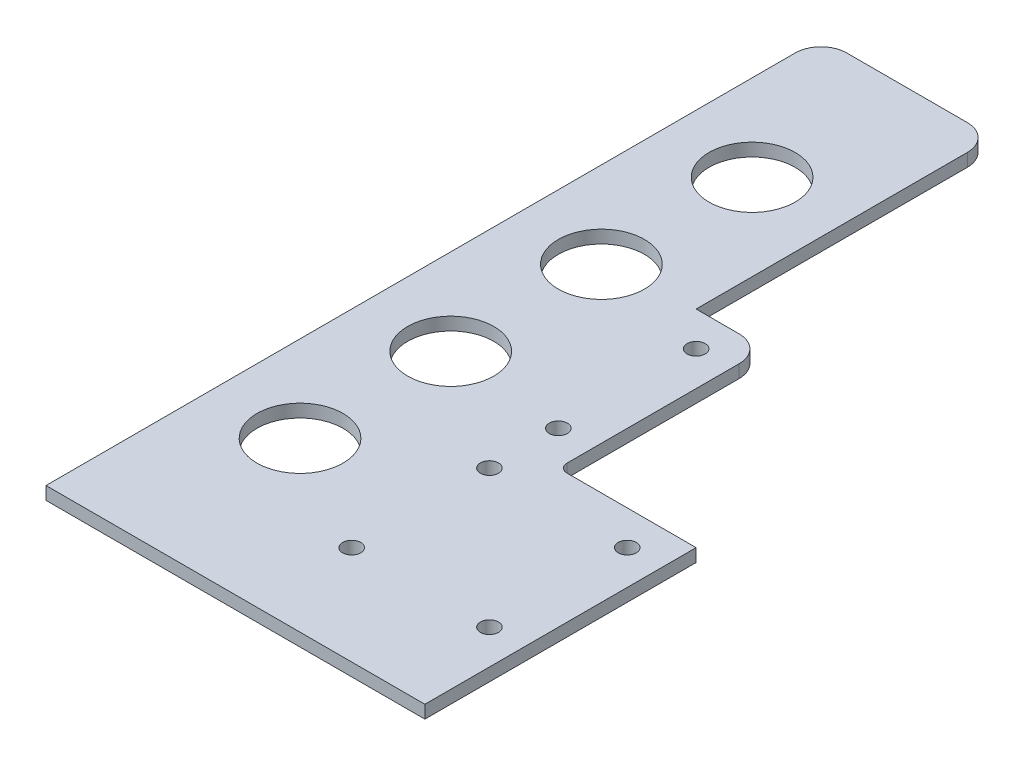
ISO-10303-21;
HEADER;
FILE_DESCRIPTION(('STEP AP214'),'2;1');
FILE_NAME('part.step','',(''),(''),'','','');
FILE_SCHEMA(('AUTOMOTIVE_DESIGN { 1 0 10303 214 1 1 1 1 }'));
ENDSEC;
DATA;
#1=APPLICATION_CONTEXT('core data for automotive mechanical design processes');
#2=APPLICATION_PROTOCOL_DEFINITION('international standard','automotive_design',2000,#1);
#3=PRODUCT_CONTEXT('',#1,'mechanical');
#4=PRODUCT('Part','Part','',(#3));
#5=PRODUCT_RELATED_PRODUCT_CATEGORY('part','',(#4));
#6=PRODUCT_DEFINITION_FORMATION('','',#4);
#7=PRODUCT_DEFINITION_CONTEXT('part definition',#1,'design');
#8=PRODUCT_DEFINITION('design','',#6,#7);
#9=PRODUCT_DEFINITION_SHAPE('','',#8);
#10=(LENGTH_UNIT() NAMED_UNIT(*) SI_UNIT(.MILLI.,.METRE.));
#11=(NAMED_UNIT(*) PLANE_ANGLE_UNIT() SI_UNIT($,.RADIAN.));
#12=(NAMED_UNIT(*) SI_UNIT($,.STERADIAN.) SOLID_ANGLE_UNIT());
#13=UNCERTAINTY_MEASURE_WITH_UNIT(LENGTH_MEASURE(1.E-05),#10,'distance_accuracy_value','');
#14=(GEOMETRIC_REPRESENTATION_CONTEXT(3) GLOBAL_UNCERTAINTY_ASSIGNED_CONTEXT((#13)) GLOBAL_UNIT_ASSIGNED_CONTEXT((#10,
#11,#12)) REPRESENTATION_CONTEXT('',''));
#15=CARTESIAN_POINT('',(0.,0.,0.));
#16=DIRECTION('',(0.,0.,1.));
#17=DIRECTION('',(1.,0.,0.));
#18=AXIS2_PLACEMENT_3D('',#15,#16,#17);
#19=CARTESIAN_POINT('',(-58.,3.,-135.));
#20=DIRECTION('',(0.,-1.,0.));
#21=DIRECTION('',(0.,0.,-1.));
#22=AXIS2_PLACEMENT_3D('',#19,#20,#21);
#23=PLANE('',#22);
#24=DIRECTION('',(0.,0.,1.));
#25=VECTOR('',#24,1.);
#26=CARTESIAN_POINT('',(-64.,3.,43.));
#27=LINE('',#26,#25);
#28=CARTESIAN_POINT('',(-64.,3.,-135.));
#29=VERTEX_POINT('',#28);
#30=CARTESIAN_POINT('',(-64.,3.,39.));
#31=VERTEX_POINT('',#30);
#32=EDGE_CURVE('E165',#29,#31,#27,.T.);
#33=ORIENTED_EDGE('',*,*,#32,.T.);
#34=DIRECTION('',(1.,0.,0.));
#35=VECTOR('',#34,1.);
#36=CARTESIAN_POINT('',(-58.,3.,39.));
#37=LINE('',#36,#35);
#38=CARTESIAN_POINT('',(24.,3.,39.));
#39=VERTEX_POINT('',#38);
#40=EDGE_CURVE('E60',#31,#39,#37,.T.);
#41=ORIENTED_EDGE('',*,*,#40,.T.);
#42=DIRECTION('',(0.,0.,-1.));
#43=VECTOR('',#42,1.);
#44=CARTESIAN_POINT('',(24.,3.,-24.));
#45=LINE('',#44,#43);
#46=CARTESIAN_POINT('',(24.,3.,-24.));
#47=VERTEX_POINT('',#46);
#48=EDGE_CURVE('E115',#39,#47,#45,.T.);
#49=ORIENTED_EDGE('',*,*,#48,.T.);
#50=DIRECTION('',(-1.,0.,0.));
#51=VECTOR('',#50,1.);
#52=CARTESIAN_POINT('',(-5.99999999999999,3.,-24.));
#53=LINE('',#52,#51);
#54=CARTESIAN_POINT('',(-6.,3.,-24.));
#55=VERTEX_POINT('',#54);
#56=EDGE_CURVE('E267',#47,#55,#53,.T.);
#57=ORIENTED_EDGE('',*,*,#56,.T.);
#58=CARTESIAN_POINT('',(-6.,3.,-26.));
#59=DIRECTION('',(0.,-1.,0.));
#60=DIRECTION('',(0.,0.,1.));
#61=AXIS2_PLACEMENT_3D('',#58,#59,#60);
#62=CIRCLE('',#61,2.);
#63=CARTESIAN_POINT('',(-8.,3.,-26.));
#64=VERTEX_POINT('',#63);
#65=EDGE_CURVE('E234',#55,#64,#62,.T.);
#66=ORIENTED_EDGE('',*,*,#65,.T.);
#67=DIRECTION('',(0.,0.,-1.));
#68=VECTOR('',#67,1.);
#69=CARTESIAN_POINT('',(-8.,3.,-26.));
#70=LINE('',#69,#68);
#71=CARTESIAN_POINT('',(-8.,3.,-66.));
#72=VERTEX_POINT('',#71);
#73=EDGE_CURVE('E257',#64,#72,#70,.T.);
#74=ORIENTED_EDGE('',*,*,#73,.T.);
#75=CARTESIAN_POINT('',(-14.,3.,-66.));
#76=DIRECTION('',(0.,1.,0.));
#77=DIRECTION('',(0.,0.,1.));
#78=AXIS2_PLACEMENT_3D('',#75,#76,#77);
#79=CIRCLE('',#78,6.);
#80=CARTESIAN_POINT('',(-14.,3.,-72.));
#81=VERTEX_POINT('',#80);
#82=EDGE_CURVE('E253',#72,#81,#79,.T.);
#83=ORIENTED_EDGE('',*,*,#82,.T.);
#84=DIRECTION('',(-1.,0.,0.));
#85=VECTOR('',#84,1.);
#86=CARTESIAN_POINT('',(-14.,3.,-72.));
#87=LINE('',#86,#85);
#88=CARTESIAN_POINT('',(-24.,3.,-72.));
#89=VERTEX_POINT('',#88);
#90=EDGE_CURVE('E256',#81,#89,#87,.T.);
#91=ORIENTED_EDGE('',*,*,#90,.T.);
#92=DIRECTION('',(0.,0.,-1.));
#93=VECTOR('',#92,1.);
#94=CARTESIAN_POINT('',(-24.,3.,-135.));
#95=LINE('',#94,#93);
#96=CARTESIAN_POINT('',(-24.,3.,-135.));
#97=VERTEX_POINT('',#96);
#98=EDGE_CURVE('E144',#89,#97,#95,.T.);
#99=ORIENTED_EDGE('',*,*,#98,.T.);
#100=CARTESIAN_POINT('',(-30.,3.,-135.));
#101=DIRECTION('',(0.,1.,0.));
#102=DIRECTION('',(0.,0.,1.));
#103=AXIS2_PLACEMENT_3D('',#100,#101,#102);
#104=CIRCLE('',#103,6.);
#105=CARTESIAN_POINT('',(-30.,3.,-141.));
#106=VERTEX_POINT('',#105);
#107=EDGE_CURVE('E137',#97,#106,#104,.T.);
#108=ORIENTED_EDGE('',*,*,#107,.T.);
#109=DIRECTION('',(-1.,0.,0.));
#110=VECTOR('',#109,1.);
#111=CARTESIAN_POINT('',(-58.,3.,-141.));
#112=LINE('',#111,#110);
#113=CARTESIAN_POINT('',(-58.,3.,-141.));
#114=VERTEX_POINT('',#113);
#115=EDGE_CURVE('E141',#106,#114,#112,.T.);
#116=ORIENTED_EDGE('',*,*,#115,.T.);
#117=CARTESIAN_POINT('',(-58.,3.,-135.));
#118=DIRECTION('',(0.,1.,0.));
#119=DIRECTION('',(0.,0.,-1.));
#120=AXIS2_PLACEMENT_3D('',#117,#118,#119);
#121=CIRCLE('',#120,6.);
#122=EDGE_CURVE('E69',#114,#29,#121,.T.);
#123=ORIENTED_EDGE('',*,*,#122,.T.);
#124=EDGE_LOOP('',(#33,#41,#49,#57,#66,#74,#83,#91,#99,#108,#116,#123));
#125=FACE_BOUND('',#124,.T.);
#126=CARTESIAN_POINT('',(16.,3.,-16.));
#127=DIRECTION('',(0.,1.,0.));
#128=DIRECTION('',(0.,0.,1.));
#129=AXIS2_PLACEMENT_3D('',#126,#127,#128);
#130=CIRCLE('',#129,2.1);
#131=CARTESIAN_POINT('',(16.,3.,-13.9));
#132=VERTEX_POINT('',#131);
#133=EDGE_CURVE('E176',#132,#132,#130,.T.);
#134=ORIENTED_EDGE('',*,*,#133,.F.);
#135=EDGE_LOOP('',(#134));
#136=FACE_BOUND('',#135,.T.);
#137=CARTESIAN_POINT('',(16.,3.,16.));
#138=DIRECTION('',(0.,1.,0.));
#139=DIRECTION('',(0.,0.,1.));
#140=AXIS2_PLACEMENT_3D('',#137,#138,#139);
#141=CIRCLE('',#140,2.1);
#142=CARTESIAN_POINT('',(16.,3.,18.1));
#143=VERTEX_POINT('',#142);
#144=EDGE_CURVE('E276',#143,#143,#141,.T.);
#145=ORIENTED_EDGE('',*,*,#144,.F.);
#146=EDGE_LOOP('',(#145));
#147=FACE_BOUND('',#146,.T.);
#148=CARTESIAN_POINT('',(-16.,3.,16.));
#149=DIRECTION('',(0.,1.,0.));
#150=DIRECTION('',(0.,0.,1.));
#151=AXIS2_PLACEMENT_3D('',#148,#149,#150);
#152=CIRCLE('',#151,2.1);
#153=CARTESIAN_POINT('',(-16.,3.,18.1));
#154=VERTEX_POINT('',#153);
#155=EDGE_CURVE('E284',#154,#154,#152,.T.);
#156=ORIENTED_EDGE('',*,*,#155,.F.);
#157=EDGE_LOOP('',(#156));
#158=FACE_BOUND('',#157,.T.);
#159=CARTESIAN_POINT('',(-16.,3.,-16.));
#160=DIRECTION('',(0.,1.,0.));
#161=DIRECTION('',(0.,0.,1.));
#162=AXIS2_PLACEMENT_3D('',#159,#160,#161);
#163=CIRCLE('',#162,2.1);
#164=CARTESIAN_POINT('',(-16.,3.,-13.9));
#165=VERTEX_POINT('',#164);
#166=EDGE_CURVE('E292',#165,#165,#163,.T.);
#167=ORIENTED_EDGE('',*,*,#166,.F.);
#168=EDGE_LOOP('',(#167));
#169=FACE_BOUND('',#168,.T.);
#170=CARTESIAN_POINT('',(-16.0000000000001,3.,-32.));
#171=DIRECTION('',(0.,1.,0.));
#172=DIRECTION('',(0.,0.,1.));
#173=AXIS2_PLACEMENT_3D('',#170,#171,#172);
#174=CIRCLE('',#173,2.1);
#175=CARTESIAN_POINT('',(-16.0000000000001,3.,-29.9));
#176=VERTEX_POINT('',#175);
#177=EDGE_CURVE('E300',#176,#176,#174,.T.);
#178=ORIENTED_EDGE('',*,*,#177,.F.);
#179=EDGE_LOOP('',(#178));
#180=FACE_BOUND('',#179,.T.);
#181=CARTESIAN_POINT('',(-16.0000000000002,3.,-64.));
#182=DIRECTION('',(0.,1.,0.));
#183=DIRECTION('',(0.,0.,1.));
#184=AXIS2_PLACEMENT_3D('',#181,#182,#183);
#185=CIRCLE('',#184,2.1);
#186=CARTESIAN_POINT('',(-16.0000000000002,3.,-61.9));
#187=VERTEX_POINT('',#186);
#188=EDGE_CURVE('E308',#187,#187,#185,.T.);
#189=ORIENTED_EDGE('',*,*,#188,.F.);
#190=EDGE_LOOP('',(#189));
#191=FACE_BOUND('',#190,.T.);
#192=CARTESIAN_POINT('',(-44.,3.,0.));
#193=DIRECTION('',(0.,1.,0.));
#194=DIRECTION('',(0.,0.,1.));
#195=AXIS2_PLACEMENT_3D('',#192,#193,#194);
#196=CIRCLE('',#195,10.);
#197=CARTESIAN_POINT('',(-44.,3.,10.));
#198=VERTEX_POINT('',#197);
#199=EDGE_CURVE('E316',#198,#198,#196,.T.);
#200=ORIENTED_EDGE('',*,*,#199,.F.);
#201=EDGE_LOOP('',(#200));
#202=FACE_BOUND('',#201,.T.);
#203=CARTESIAN_POINT('',(-44.0000000000001,3.,-35.));
#204=DIRECTION('',(0.,1.,0.));
#205=DIRECTION('',(0.,0.,1.));
#206=AXIS2_PLACEMENT_3D('',#203,#204,#205);
#207=CIRCLE('',#206,10.);
#208=CARTESIAN_POINT('',(-44.0000000000001,3.,-25.));
#209=VERTEX_POINT('',#208);
#210=EDGE_CURVE('E324',#209,#209,#207,.T.);
#211=ORIENTED_EDGE('',*,*,#210,.F.);
#212=EDGE_LOOP('',(#211));
#213=FACE_BOUND('',#212,.T.);
#214=CARTESIAN_POINT('',(-44.0000000000002,3.,-70.));
#215=DIRECTION('',(0.,1.,0.));
#216=DIRECTION('',(0.,0.,1.));
#217=AXIS2_PLACEMENT_3D('',#214,#215,#216);
#218=CIRCLE('',#217,10.);
#219=CARTESIAN_POINT('',(-44.0000000000002,3.,-60.));
#220=VERTEX_POINT('',#219);
#221=EDGE_CURVE('E332',#220,#220,#218,.T.);
#222=ORIENTED_EDGE('',*,*,#221,.F.);
#223=EDGE_LOOP('',(#222));
#224=FACE_BOUND('',#223,.T.);
#225=CARTESIAN_POINT('',(-44.0000000000004,3.,-105.));
#226=DIRECTION('',(0.,1.,0.));
#227=DIRECTION('',(0.,0.,1.));
#228=AXIS2_PLACEMENT_3D('',#225,#226,#227);
#229=CIRCLE('',#228,10.);
#230=CARTESIAN_POINT('',(-44.0000000000004,3.,-95.));
#231=VERTEX_POINT('',#230);
#232=EDGE_CURVE('E340',#231,#231,#229,.T.);
#233=ORIENTED_EDGE('',*,*,#232,.F.);
#234=EDGE_LOOP('',(#233));
#235=FACE_BOUND('',#234,.T.);
#236=ADVANCED_FACE('F44',(#125,#136,#147,#158,#169,#180,#191,#202,#213,#224,#235),#23,.F.);
#237=CARTESIAN_POINT('',(-58.,0.,-135.));
#238=DIRECTION('',(0.,-1.,0.));
#239=DIRECTION('',(0.,0.,-1.));
#240=AXIS2_PLACEMENT_3D('',#237,#238,#239);
#241=PLANE('',#240);
#242=DIRECTION('',(-1.,0.,0.));
#243=VECTOR('',#242,1.);
#244=CARTESIAN_POINT('',(-64.,0.,39.));
#245=LINE('',#244,#243);
#246=CARTESIAN_POINT('',(24.,0.,39.));
#247=VERTEX_POINT('',#246);
#248=CARTESIAN_POINT('',(-64.,0.,39.));
#249=VERTEX_POINT('',#248);
#250=EDGE_CURVE('E357',#247,#249,#245,.T.);
#251=ORIENTED_EDGE('',*,*,#250,.T.);
#252=DIRECTION('',(0.,0.,1.));
#253=VECTOR('',#252,1.);
#254=CARTESIAN_POINT('',(-64.,0.,43.));
#255=LINE('',#254,#253);
#256=CARTESIAN_POINT('',(-64.,0.,-135.));
#257=VERTEX_POINT('',#256);
#258=EDGE_CURVE('E201',#257,#249,#255,.T.);
#259=ORIENTED_EDGE('',*,*,#258,.F.);
#260=CARTESIAN_POINT('',(-58.,0.,-135.));
#261=DIRECTION('',(0.,1.,0.));
#262=DIRECTION('',(0.,0.,-1.));
#263=AXIS2_PLACEMENT_3D('',#260,#261,#262);
#264=CIRCLE('',#263,6.);
#265=CARTESIAN_POINT('',(-58.,0.,-141.));
#266=VERTEX_POINT('',#265);
#267=EDGE_CURVE('E108',#266,#257,#264,.T.);
#268=ORIENTED_EDGE('',*,*,#267,.F.);
#269=DIRECTION('',(-1.,0.,0.));
#270=VECTOR('',#269,1.);
#271=CARTESIAN_POINT('',(-58.,0.,-141.));
#272=LINE('',#271,#270);
#273=CARTESIAN_POINT('',(-30.,0.,-141.));
#274=VERTEX_POINT('',#273);
#275=EDGE_CURVE('E196',#274,#266,#272,.T.);
#276=ORIENTED_EDGE('',*,*,#275,.F.);
#277=CARTESIAN_POINT('',(-30.,0.,-135.));
#278=DIRECTION('',(0.,1.,0.));
#279=DIRECTION('',(0.,0.,1.));
#280=AXIS2_PLACEMENT_3D('',#277,#278,#279);
#281=CIRCLE('',#280,6.);
#282=CARTESIAN_POINT('',(-24.,0.,-135.));
#283=VERTEX_POINT('',#282);
#284=EDGE_CURVE('E154',#283,#274,#281,.T.);
#285=ORIENTED_EDGE('',*,*,#284,.F.);
#286=DIRECTION('',(0.,0.,-1.));
#287=VECTOR('',#286,1.);
#288=CARTESIAN_POINT('',(-24.,0.,-135.));
#289=LINE('',#288,#287);
#290=CARTESIAN_POINT('',(-24.,0.,-72.));
#291=VERTEX_POINT('',#290);
#292=EDGE_CURVE('E191',#291,#283,#289,.T.);
#293=ORIENTED_EDGE('',*,*,#292,.F.);
#294=DIRECTION('',(-1.,0.,0.));
#295=VECTOR('',#294,1.);
#296=CARTESIAN_POINT('',(-14.,0.,-72.));
#297=LINE('',#296,#295);
#298=CARTESIAN_POINT('',(-14.,0.,-72.));
#299=VERTEX_POINT('',#298);
#300=EDGE_CURVE('E188',#299,#291,#297,.T.);
#301=ORIENTED_EDGE('',*,*,#300,.F.);
#302=CARTESIAN_POINT('',(-14.,0.,-66.));
#303=DIRECTION('',(0.,1.,0.));
#304=DIRECTION('',(0.,0.,1.));
#305=AXIS2_PLACEMENT_3D('',#302,#303,#304);
#306=CIRCLE('',#305,6.);
#307=CARTESIAN_POINT('',(-8.,0.,-66.));
#308=VERTEX_POINT('',#307);
#309=EDGE_CURVE('E185',#308,#299,#306,.T.);
#310=ORIENTED_EDGE('',*,*,#309,.F.);
#311=DIRECTION('',(0.,0.,-1.));
#312=VECTOR('',#311,1.);
#313=CARTESIAN_POINT('',(-8.,0.,-26.));
#314=LINE('',#313,#312);
#315=CARTESIAN_POINT('',(-8.,0.,-26.));
#316=VERTEX_POINT('',#315);
#317=EDGE_CURVE('E182',#316,#308,#314,.T.);
#318=ORIENTED_EDGE('',*,*,#317,.F.);
#319=CARTESIAN_POINT('',(-6.,0.,-26.));
#320=DIRECTION('',(0.,-1.,0.));
#321=DIRECTION('',(0.,0.,1.));
#322=AXIS2_PLACEMENT_3D('',#319,#320,#321);
#323=CIRCLE('',#322,2.);
#324=CARTESIAN_POINT('',(-6.,0.,-24.));
#325=VERTEX_POINT('',#324);
#326=EDGE_CURVE('E179',#325,#316,#323,.T.);
#327=ORIENTED_EDGE('',*,*,#326,.F.);
#328=DIRECTION('',(-1.,0.,0.));
#329=VECTOR('',#328,1.);
#330=CARTESIAN_POINT('',(-5.99999999999999,0.,-24.));
#331=LINE('',#330,#329);
#332=CARTESIAN_POINT('',(24.,0.,-24.));
#333=VERTEX_POINT('',#332);
#334=EDGE_CURVE('E175',#333,#325,#331,.T.);
#335=ORIENTED_EDGE('',*,*,#334,.F.);
#336=DIRECTION('',(0.,0.,-1.));
#337=VECTOR('',#336,1.);
#338=CARTESIAN_POINT('',(24.,0.,-24.));
#339=LINE('',#338,#337);
#340=EDGE_CURVE('E172',#247,#333,#339,.T.);
#341=ORIENTED_EDGE('',*,*,#340,.F.);
#342=EDGE_LOOP('',(#251,#259,#268,#276,#285,#293,#301,#310,#318,#327,#335,#341));
#343=FACE_BOUND('',#342,.T.);
#344=CARTESIAN_POINT('',(-44.0000000000002,0.,-70.));
#345=DIRECTION('',(0.,1.,0.));
#346=DIRECTION('',(0.,0.,1.));
#347=AXIS2_PLACEMENT_3D('',#344,#345,#346);
#348=CIRCLE('',#347,10.);
#349=CARTESIAN_POINT('',(-44.0000000000002,0.,-60.));
#350=VERTEX_POINT('',#349);
#351=EDGE_CURVE('E336',#350,#350,#348,.T.);
#352=ORIENTED_EDGE('',*,*,#351,.T.);
#353=EDGE_LOOP('',(#352));
#354=FACE_BOUND('',#353,.T.);
#355=CARTESIAN_POINT('',(-44.,0.,0.));
#356=DIRECTION('',(0.,1.,0.));
#357=DIRECTION('',(0.,0.,1.));
#358=AXIS2_PLACEMENT_3D('',#355,#356,#357);
#359=CIRCLE('',#358,10.);
#360=CARTESIAN_POINT('',(-44.,0.,10.));
#361=VERTEX_POINT('',#360);
#362=EDGE_CURVE('E320',#361,#361,#359,.T.);
#363=ORIENTED_EDGE('',*,*,#362,.T.);
#364=EDGE_LOOP('',(#363));
#365=FACE_BOUND('',#364,.T.);
#366=CARTESIAN_POINT('',(-16.0000000000001,0.,-32.));
#367=DIRECTION('',(0.,1.,0.));
#368=DIRECTION('',(0.,0.,1.));
#369=AXIS2_PLACEMENT_3D('',#366,#367,#368);
#370=CIRCLE('',#369,2.1);
#371=CARTESIAN_POINT('',(-16.0000000000001,0.,-29.9));
#372=VERTEX_POINT('',#371);
#373=EDGE_CURVE('E304',#372,#372,#370,.T.);
#374=ORIENTED_EDGE('',*,*,#373,.T.);
#375=EDGE_LOOP('',(#374));
#376=FACE_BOUND('',#375,.T.);
#377=CARTESIAN_POINT('',(-16.,0.,16.));
#378=DIRECTION('',(0.,1.,0.));
#379=DIRECTION('',(0.,0.,1.));
#380=AXIS2_PLACEMENT_3D('',#377,#378,#379);
#381=CIRCLE('',#380,2.1);
#382=CARTESIAN_POINT('',(-16.,0.,18.1));
#383=VERTEX_POINT('',#382);
#384=EDGE_CURVE('E288',#383,#383,#381,.T.);
#385=ORIENTED_EDGE('',*,*,#384,.T.);
#386=EDGE_LOOP('',(#385));
#387=FACE_BOUND('',#386,.T.);
#388=CARTESIAN_POINT('',(16.,0.,-16.));
#389=DIRECTION('',(0.,1.,0.));
#390=DIRECTION('',(0.,0.,1.));
#391=AXIS2_PLACEMENT_3D('',#388,#389,#390);
#392=CIRCLE('',#391,2.1);
#393=CARTESIAN_POINT('',(16.,0.,-13.9));
#394=VERTEX_POINT('',#393);
#395=EDGE_CURVE('E272',#394,#394,#392,.T.);
#396=ORIENTED_EDGE('',*,*,#395,.T.);
#397=EDGE_LOOP('',(#396));
#398=FACE_BOUND('',#397,.T.);
#399=CARTESIAN_POINT('',(16.,0.,16.));
#400=DIRECTION('',(0.,1.,0.));
#401=DIRECTION('',(0.,0.,1.));
#402=AXIS2_PLACEMENT_3D('',#399,#400,#401);
#403=CIRCLE('',#402,2.1);
#404=CARTESIAN_POINT('',(16.,0.,18.1));
#405=VERTEX_POINT('',#404);
#406=EDGE_CURVE('E280',#405,#405,#403,.T.);
#407=ORIENTED_EDGE('',*,*,#406,.T.);
#408=EDGE_LOOP('',(#407));
#409=FACE_BOUND('',#408,.T.);
#410=CARTESIAN_POINT('',(-16.,0.,-16.));
#411=DIRECTION('',(0.,1.,0.));
#412=DIRECTION('',(0.,0.,1.));
#413=AXIS2_PLACEMENT_3D('',#410,#411,#412);
#414=CIRCLE('',#413,2.1);
#415=CARTESIAN_POINT('',(-16.,0.,-13.9));
#416=VERTEX_POINT('',#415);
#417=EDGE_CURVE('E296',#416,#416,#414,.T.);
#418=ORIENTED_EDGE('',*,*,#417,.T.);
#419=EDGE_LOOP('',(#418));
#420=FACE_BOUND('',#419,.T.);
#421=CARTESIAN_POINT('',(-16.0000000000002,0.,-64.));
#422=DIRECTION('',(0.,1.,0.));
#423=DIRECTION('',(0.,0.,1.));
#424=AXIS2_PLACEMENT_3D('',#421,#422,#423);
#425=CIRCLE('',#424,2.1);
#426=CARTESIAN_POINT('',(-16.0000000000002,0.,-61.9));
#427=VERTEX_POINT('',#426);
#428=EDGE_CURVE('E312',#427,#427,#425,.T.);
#429=ORIENTED_EDGE('',*,*,#428,.T.);
#430=EDGE_LOOP('',(#429));
#431=FACE_BOUND('',#430,.T.);
#432=CARTESIAN_POINT('',(-44.0000000000001,0.,-35.));
#433=DIRECTION('',(0.,1.,0.));
#434=DIRECTION('',(0.,0.,1.));
#435=AXIS2_PLACEMENT_3D('',#432,#433,#434);
#436=CIRCLE('',#435,10.);
#437=CARTESIAN_POINT('',(-44.0000000000001,0.,-25.));
#438=VERTEX_POINT('',#437);
#439=EDGE_CURVE('E328',#438,#438,#436,.T.);
#440=ORIENTED_EDGE('',*,*,#439,.T.);
#441=EDGE_LOOP('',(#440));
#442=FACE_BOUND('',#441,.T.);
#443=CARTESIAN_POINT('',(-44.0000000000004,0.,-105.));
#444=DIRECTION('',(0.,1.,0.));
#445=DIRECTION('',(0.,0.,1.));
#446=AXIS2_PLACEMENT_3D('',#443,#444,#445);
#447=CIRCLE('',#446,10.);
#448=CARTESIAN_POINT('',(-44.0000000000004,0.,-95.));
#449=VERTEX_POINT('',#448);
#450=EDGE_CURVE('E344',#449,#449,#447,.T.);
#451=ORIENTED_EDGE('',*,*,#450,.T.);
#452=EDGE_LOOP('',(#451));
#453=FACE_BOUND('',#452,.T.);
#454=ADVANCED_FACE('F240',(#343,#354,#365,#376,#387,#398,#409,#420,#431,#442,#453),#241,.T.);
#455=CARTESIAN_POINT('',(24.,3.,-24.));
#456=DIRECTION('',(-1.,0.,0.));
#457=DIRECTION('',(0.,0.,1.));
#458=AXIS2_PLACEMENT_3D('',#455,#456,#457);
#459=PLANE('',#458);
#460=ORIENTED_EDGE('',*,*,#48,.F.);
#461=DIRECTION('',(0.,1.,0.));
#462=VECTOR('',#461,1.);
#463=CARTESIAN_POINT('',(24.,0.,39.));
#464=LINE('',#463,#462);
#465=EDGE_CURVE('E354',#247,#39,#464,.T.);
#466=ORIENTED_EDGE('',*,*,#465,.F.);
#467=ORIENTED_EDGE('',*,*,#340,.T.);
#468=DIRECTION('',(0.,-1.,0.));
#469=VECTOR('',#468,1.);
#470=CARTESIAN_POINT('',(24.,3.,-24.));
#471=LINE('',#470,#469);
#472=EDGE_CURVE('E11',#47,#333,#471,.T.);
#473=ORIENTED_EDGE('',*,*,#472,.F.);
#474=EDGE_LOOP('',(#460,#466,#467,#473));
#475=FACE_BOUND('',#474,.T.);
#476=ADVANCED_FACE('F46',(#475),#459,.F.);
#477=CARTESIAN_POINT('',(-5.99999999999999,3.,-24.));
#478=DIRECTION('',(0.,0.,1.));
#479=DIRECTION('',(1.,0.,0.));
#480=AXIS2_PLACEMENT_3D('',#477,#478,#479);
#481=PLANE('',#480);
#482=ORIENTED_EDGE('',*,*,#334,.T.);
#483=DIRECTION('',(0.,-1.,0.));
#484=VECTOR('',#483,1.);
#485=CARTESIAN_POINT('',(-6.,3.,-24.));
#486=LINE('',#485,#484);
#487=EDGE_CURVE('E53',#55,#325,#486,.T.);
#488=ORIENTED_EDGE('',*,*,#487,.F.);
#489=ORIENTED_EDGE('',*,*,#56,.F.);
#490=ORIENTED_EDGE('',*,*,#472,.T.);
#491=EDGE_LOOP('',(#482,#488,#489,#490));
#492=FACE_BOUND('',#491,.T.);
#493=ADVANCED_FACE('F523',(#492),#481,.F.);
#494=CARTESIAN_POINT('',(-6.,3.,-26.));
#495=DIRECTION('',(0.,-1.,0.));
#496=DIRECTION('',(0.,0.,-1.));
#497=AXIS2_PLACEMENT_3D('',#494,#495,#496);
#498=CYLINDRICAL_SURFACE('',#497,2.);
#499=ORIENTED_EDGE('',*,*,#326,.T.);
#500=DIRECTION('',(0.,-1.,0.));
#501=VECTOR('',#500,1.);
#502=CARTESIAN_POINT('',(-8.,3.,-26.));
#503=LINE('',#502,#501);
#504=EDGE_CURVE('E223',#64,#316,#503,.T.);
#505=ORIENTED_EDGE('',*,*,#504,.F.);
#506=ORIENTED_EDGE('',*,*,#65,.F.);
#507=ORIENTED_EDGE('',*,*,#487,.T.);
#508=EDGE_LOOP('',(#499,#505,#506,#507));
#509=FACE_BOUND('',#508,.T.);
#510=ADVANCED_FACE('F232',(#509),#498,.F.);
#511=CARTESIAN_POINT('',(-8.,3.,-26.));
#512=DIRECTION('',(-1.,0.,0.));
#513=DIRECTION('',(0.,0.,1.));
#514=AXIS2_PLACEMENT_3D('',#511,#512,#513);
#515=PLANE('',#514);
#516=ORIENTED_EDGE('',*,*,#317,.T.);
#517=DIRECTION('',(0.,-1.,0.));
#518=VECTOR('',#517,1.);
#519=CARTESIAN_POINT('',(-8.,3.,-66.));
#520=LINE('',#519,#518);
#521=EDGE_CURVE('E219',#72,#308,#520,.T.);
#522=ORIENTED_EDGE('',*,*,#521,.F.);
#523=ORIENTED_EDGE('',*,*,#73,.F.);
#524=ORIENTED_EDGE('',*,*,#504,.T.);
#525=EDGE_LOOP('',(#516,#522,#523,#524));
#526=FACE_BOUND('',#525,.T.);
#527=ADVANCED_FACE('F247',(#526),#515,.F.);
#528=CARTESIAN_POINT('',(-14.,3.,-66.));
#529=DIRECTION('',(0.,-1.,0.));
#530=DIRECTION('',(0.,0.,-1.));
#531=AXIS2_PLACEMENT_3D('',#528,#529,#530);
#532=CYLINDRICAL_SURFACE('',#531,6.);
#533=ORIENTED_EDGE('',*,*,#309,.T.);
#534=DIRECTION('',(0.,-1.,0.));
#535=VECTOR('',#534,1.);
#536=CARTESIAN_POINT('',(-14.,3.,-72.));
#537=LINE('',#536,#535);
#538=EDGE_CURVE('E215',#81,#299,#537,.T.);
#539=ORIENTED_EDGE('',*,*,#538,.F.);
#540=ORIENTED_EDGE('',*,*,#82,.F.);
#541=ORIENTED_EDGE('',*,*,#521,.T.);
#542=EDGE_LOOP('',(#533,#539,#540,#541));
#543=FACE_BOUND('',#542,.T.);
#544=ADVANCED_FACE('F251',(#543),#532,.T.);
#545=CARTESIAN_POINT('',(-14.,3.,-72.));
#546=DIRECTION('',(0.,0.,1.));
#547=DIRECTION('',(1.,0.,0.));
#548=AXIS2_PLACEMENT_3D('',#545,#546,#547);
#549=PLANE('',#548);
#550=ORIENTED_EDGE('',*,*,#300,.T.);
#551=DIRECTION('',(0.,-1.,0.));
#552=VECTOR('',#551,1.);
#553=CARTESIAN_POINT('',(-24.,3.,-72.));
#554=LINE('',#553,#552);
#555=EDGE_CURVE('E211',#89,#291,#554,.T.);
#556=ORIENTED_EDGE('',*,*,#555,.F.);
#557=ORIENTED_EDGE('',*,*,#90,.F.);
#558=ORIENTED_EDGE('',*,*,#538,.T.);
#559=EDGE_LOOP('',(#550,#556,#557,#558));
#560=FACE_BOUND('',#559,.T.);
#561=ADVANCED_FACE('F375',(#560),#549,.F.);
#562=CARTESIAN_POINT('',(-24.,3.,-135.));
#563=DIRECTION('',(-1.,0.,0.));
#564=DIRECTION('',(0.,0.,1.));
#565=AXIS2_PLACEMENT_3D('',#562,#563,#564);
#566=PLANE('',#565);
#567=ORIENTED_EDGE('',*,*,#292,.T.);
#568=DIRECTION('',(0.,-1.,0.));
#569=VECTOR('',#568,1.);
#570=CARTESIAN_POINT('',(-24.,3.,-135.));
#571=LINE('',#570,#569);
#572=EDGE_CURVE('E158',#97,#283,#571,.T.);
#573=ORIENTED_EDGE('',*,*,#572,.F.);
#574=ORIENTED_EDGE('',*,*,#98,.F.);
#575=ORIENTED_EDGE('',*,*,#555,.T.);
#576=EDGE_LOOP('',(#567,#573,#574,#575));
#577=FACE_BOUND('',#576,.T.);
#578=ADVANCED_FACE('F372',(#577),#566,.F.);
#579=CARTESIAN_POINT('',(-30.,3.,-135.));
#580=DIRECTION('',(0.,-1.,0.));
#581=DIRECTION('',(0.,0.,-1.));
#582=AXIS2_PLACEMENT_3D('',#579,#580,#581);
#583=CYLINDRICAL_SURFACE('',#582,6.);
#584=ORIENTED_EDGE('',*,*,#284,.T.);
#585=DIRECTION('',(0.,-1.,0.));
#586=VECTOR('',#585,1.);
#587=CARTESIAN_POINT('',(-30.,3.,-141.));
#588=LINE('',#587,#586);
#589=EDGE_CURVE('E151',#106,#274,#588,.T.);
#590=ORIENTED_EDGE('',*,*,#589,.F.);
#591=ORIENTED_EDGE('',*,*,#107,.F.);
#592=ORIENTED_EDGE('',*,*,#572,.T.);
#593=EDGE_LOOP('',(#584,#590,#591,#592));
#594=FACE_BOUND('',#593,.T.);
#595=ADVANCED_FACE('F152',(#594),#583,.T.);
#596=CARTESIAN_POINT('',(-58.,3.,-141.));
#597=DIRECTION('',(0.,0.,1.));
#598=DIRECTION('',(1.,0.,0.));
#599=AXIS2_PLACEMENT_3D('',#596,#597,#598);
#600=PLANE('',#599);
#601=ORIENTED_EDGE('',*,*,#275,.T.);
#602=DIRECTION('',(0.,-1.,0.));
#603=VECTOR('',#602,1.);
#604=CARTESIAN_POINT('',(-58.,3.,-141.));
#605=LINE('',#604,#603);
#606=EDGE_CURVE('E159',#114,#266,#605,.T.);
#607=ORIENTED_EDGE('',*,*,#606,.F.);
#608=ORIENTED_EDGE('',*,*,#115,.F.);
#609=ORIENTED_EDGE('',*,*,#589,.T.);
#610=EDGE_LOOP('',(#601,#607,#608,#609));
#611=FACE_BOUND('',#610,.T.);
#612=ADVANCED_FACE('F161',(#611),#600,.F.);
#613=CARTESIAN_POINT('',(-58.,3.,-135.));
#614=DIRECTION('',(0.,-1.,0.));
#615=DIRECTION('',(0.,0.,-1.));
#616=AXIS2_PLACEMENT_3D('',#613,#614,#615);
#617=CYLINDRICAL_SURFACE('',#616,6.);
#618=ORIENTED_EDGE('',*,*,#267,.T.);
#619=DIRECTION('',(0.,-1.,0.));
#620=VECTOR('',#619,1.);
#621=CARTESIAN_POINT('',(-64.,3.,-135.));
#622=LINE('',#621,#620);
#623=EDGE_CURVE('E171',#29,#257,#622,.T.);
#624=ORIENTED_EDGE('',*,*,#623,.F.);
#625=ORIENTED_EDGE('',*,*,#122,.F.);
#626=ORIENTED_EDGE('',*,*,#606,.T.);
#627=EDGE_LOOP('',(#618,#624,#625,#626));
#628=FACE_BOUND('',#627,.T.);
#629=ADVANCED_FACE('F369',(#628),#617,.T.);
#630=CARTESIAN_POINT('',(-64.,3.,43.));
#631=DIRECTION('',(1.,0.,0.));
#632=DIRECTION('',(0.,0.,-1.));
#633=AXIS2_PLACEMENT_3D('',#630,#631,#632);
#634=PLANE('',#633);
#635=ORIENTED_EDGE('',*,*,#258,.T.);
#636=DIRECTION('',(0.,1.,0.));
#637=VECTOR('',#636,1.);
#638=CARTESIAN_POINT('',(-64.,0.,39.));
#639=LINE('',#638,#637);
#640=EDGE_CURVE('E353',#249,#31,#639,.T.);
#641=ORIENTED_EDGE('',*,*,#640,.T.);
#642=ORIENTED_EDGE('',*,*,#32,.F.);
#643=ORIENTED_EDGE('',*,*,#623,.T.);
#644=EDGE_LOOP('',(#635,#641,#642,#643));
#645=FACE_BOUND('',#644,.T.);
#646=ADVANCED_FACE('F367',(#645),#634,.F.);
#647=CARTESIAN_POINT('',(16.,3.,-16.));
#648=DIRECTION('',(0.,-1.,0.));
#649=DIRECTION('',(0.,0.,-1.));
#650=AXIS2_PLACEMENT_3D('',#647,#648,#649);
#651=CYLINDRICAL_SURFACE('',#650,2.1);
#652=ORIENTED_EDGE('',*,*,#133,.T.);
#653=EDGE_LOOP('',(#652));
#654=FACE_BOUND('',#653,.T.);
#655=ORIENTED_EDGE('',*,*,#395,.F.);
#656=EDGE_LOOP('',(#655));
#657=FACE_BOUND('',#656,.T.);
#658=ADVANCED_FACE('F392',(#654,#657),#651,.F.);
#659=CARTESIAN_POINT('',(16.,3.,16.));
#660=DIRECTION('',(0.,-1.,0.));
#661=DIRECTION('',(0.,0.,-1.));
#662=AXIS2_PLACEMENT_3D('',#659,#660,#661);
#663=CYLINDRICAL_SURFACE('',#662,2.1);
#664=ORIENTED_EDGE('',*,*,#144,.T.);
#665=EDGE_LOOP('',(#664));
#666=FACE_BOUND('',#665,.T.);
#667=ORIENTED_EDGE('',*,*,#406,.F.);
#668=EDGE_LOOP('',(#667));
#669=FACE_BOUND('',#668,.T.);
#670=ADVANCED_FACE('F424',(#666,#669),#663,.F.);
#671=CARTESIAN_POINT('',(-16.,3.,16.));
#672=DIRECTION('',(0.,-1.,0.));
#673=DIRECTION('',(0.,0.,-1.));
#674=AXIS2_PLACEMENT_3D('',#671,#672,#673);
#675=CYLINDRICAL_SURFACE('',#674,2.1);
#676=ORIENTED_EDGE('',*,*,#155,.T.);
#677=EDGE_LOOP('',(#676));
#678=FACE_BOUND('',#677,.T.);
#679=ORIENTED_EDGE('',*,*,#384,.F.);
#680=EDGE_LOOP('',(#679));
#681=FACE_BOUND('',#680,.T.);
#682=ADVANCED_FACE('F432',(#678,#681),#675,.F.);
#683=CARTESIAN_POINT('',(-16.,3.,-16.));
#684=DIRECTION('',(0.,-1.,0.));
#685=DIRECTION('',(0.,0.,-1.));
#686=AXIS2_PLACEMENT_3D('',#683,#684,#685);
#687=CYLINDRICAL_SURFACE('',#686,2.1);
#688=ORIENTED_EDGE('',*,*,#166,.T.);
#689=EDGE_LOOP('',(#688));
#690=FACE_BOUND('',#689,.T.);
#691=ORIENTED_EDGE('',*,*,#417,.F.);
#692=EDGE_LOOP('',(#691));
#693=FACE_BOUND('',#692,.T.);
#694=ADVANCED_FACE('F440',(#690,#693),#687,.F.);
#695=CARTESIAN_POINT('',(-16.0000000000001,3.,-32.));
#696=DIRECTION('',(0.,-1.,0.));
#697=DIRECTION('',(0.,0.,-1.));
#698=AXIS2_PLACEMENT_3D('',#695,#696,#697);
#699=CYLINDRICAL_SURFACE('',#698,2.1);
#700=ORIENTED_EDGE('',*,*,#177,.T.);
#701=EDGE_LOOP('',(#700));
#702=FACE_BOUND('',#701,.T.);
#703=ORIENTED_EDGE('',*,*,#373,.F.);
#704=EDGE_LOOP('',(#703));
#705=FACE_BOUND('',#704,.T.);
#706=ADVANCED_FACE('F449',(#702,#705),#699,.F.);
#707=CARTESIAN_POINT('',(-16.0000000000002,3.,-64.));
#708=DIRECTION('',(0.,-1.,0.));
#709=DIRECTION('',(0.,0.,-1.));
#710=AXIS2_PLACEMENT_3D('',#707,#708,#709);
#711=CYLINDRICAL_SURFACE('',#710,2.1);
#712=ORIENTED_EDGE('',*,*,#188,.T.);
#713=EDGE_LOOP('',(#712));
#714=FACE_BOUND('',#713,.T.);
#715=ORIENTED_EDGE('',*,*,#428,.F.);
#716=EDGE_LOOP('',(#715));
#717=FACE_BOUND('',#716,.T.);
#718=ADVANCED_FACE('F458',(#714,#717),#711,.F.);
#719=CARTESIAN_POINT('',(-44.,3.,0.));
#720=DIRECTION('',(0.,-1.,0.));
#721=DIRECTION('',(0.,0.,-1.));
#722=AXIS2_PLACEMENT_3D('',#719,#720,#721);
#723=CYLINDRICAL_SURFACE('',#722,10.);
#724=ORIENTED_EDGE('',*,*,#199,.T.);
#725=EDGE_LOOP('',(#724));
#726=FACE_BOUND('',#725,.T.);
#727=ORIENTED_EDGE('',*,*,#362,.F.);
#728=EDGE_LOOP('',(#727));
#729=FACE_BOUND('',#728,.T.);
#730=ADVANCED_FACE('F467',(#726,#729),#723,.F.);
#731=CARTESIAN_POINT('',(-44.0000000000001,3.,-35.));
#732=DIRECTION('',(0.,-1.,0.));
#733=DIRECTION('',(0.,0.,-1.));
#734=AXIS2_PLACEMENT_3D('',#731,#732,#733);
#735=CYLINDRICAL_SURFACE('',#734,10.);
#736=ORIENTED_EDGE('',*,*,#210,.T.);
#737=EDGE_LOOP('',(#736));
#738=FACE_BOUND('',#737,.T.);
#739=ORIENTED_EDGE('',*,*,#439,.F.);
#740=EDGE_LOOP('',(#739));
#741=FACE_BOUND('',#740,.T.);
#742=ADVANCED_FACE('F476',(#738,#741),#735,.F.);
#743=CARTESIAN_POINT('',(-44.0000000000002,3.,-70.));
#744=DIRECTION('',(0.,-1.,0.));
#745=DIRECTION('',(0.,0.,-1.));
#746=AXIS2_PLACEMENT_3D('',#743,#744,#745);
#747=CYLINDRICAL_SURFACE('',#746,10.);
#748=ORIENTED_EDGE('',*,*,#221,.T.);
#749=EDGE_LOOP('',(#748));
#750=FACE_BOUND('',#749,.T.);
#751=ORIENTED_EDGE('',*,*,#351,.F.);
#752=EDGE_LOOP('',(#751));
#753=FACE_BOUND('',#752,.T.);
#754=ADVANCED_FACE('F485',(#750,#753),#747,.F.);
#755=CARTESIAN_POINT('',(-44.0000000000004,3.,-105.));
#756=DIRECTION('',(0.,-1.,0.));
#757=DIRECTION('',(0.,0.,-1.));
#758=AXIS2_PLACEMENT_3D('',#755,#756,#757);
#759=CYLINDRICAL_SURFACE('',#758,10.);
#760=ORIENTED_EDGE('',*,*,#232,.T.);
#761=EDGE_LOOP('',(#760));
#762=FACE_BOUND('',#761,.T.);
#763=ORIENTED_EDGE('',*,*,#450,.F.);
#764=EDGE_LOOP('',(#763));
#765=FACE_BOUND('',#764,.T.);
#766=ADVANCED_FACE('F493',(#762,#765),#759,.F.);
#767=CARTESIAN_POINT('',(-64.,0.,39.));
#768=DIRECTION('',(0.,0.,-1.));
#769=DIRECTION('',(-1.,0.,0.));
#770=AXIS2_PLACEMENT_3D('',#767,#768,#769);
#771=PLANE('',#770);
#772=ORIENTED_EDGE('',*,*,#640,.F.);
#773=ORIENTED_EDGE('',*,*,#250,.F.);
#774=ORIENTED_EDGE('',*,*,#465,.T.);
#775=ORIENTED_EDGE('',*,*,#40,.F.);
#776=EDGE_LOOP('',(#772,#773,#774,#775));
#777=FACE_BOUND('',#776,.T.);
#778=ADVANCED_FACE('F501',(#777),#771,.F.);
#779=CLOSED_SHELL('',(#236,#454,#476,#493,#510,#527,#544,#561,#578,#595,#612,#629,#646,#658,
#670,#682,#694,#706,#718,#730,#742,#754,#766,#778));
#780=MANIFOLD_SOLID_BREP('B2',#779);
#781=ADVANCED_BREP_SHAPE_REPRESENTATION('',(#18,#780),#14);
#782=SHAPE_DEFINITION_REPRESENTATION(#9,#781);
ENDSEC;
END-ISO-10303-21;
